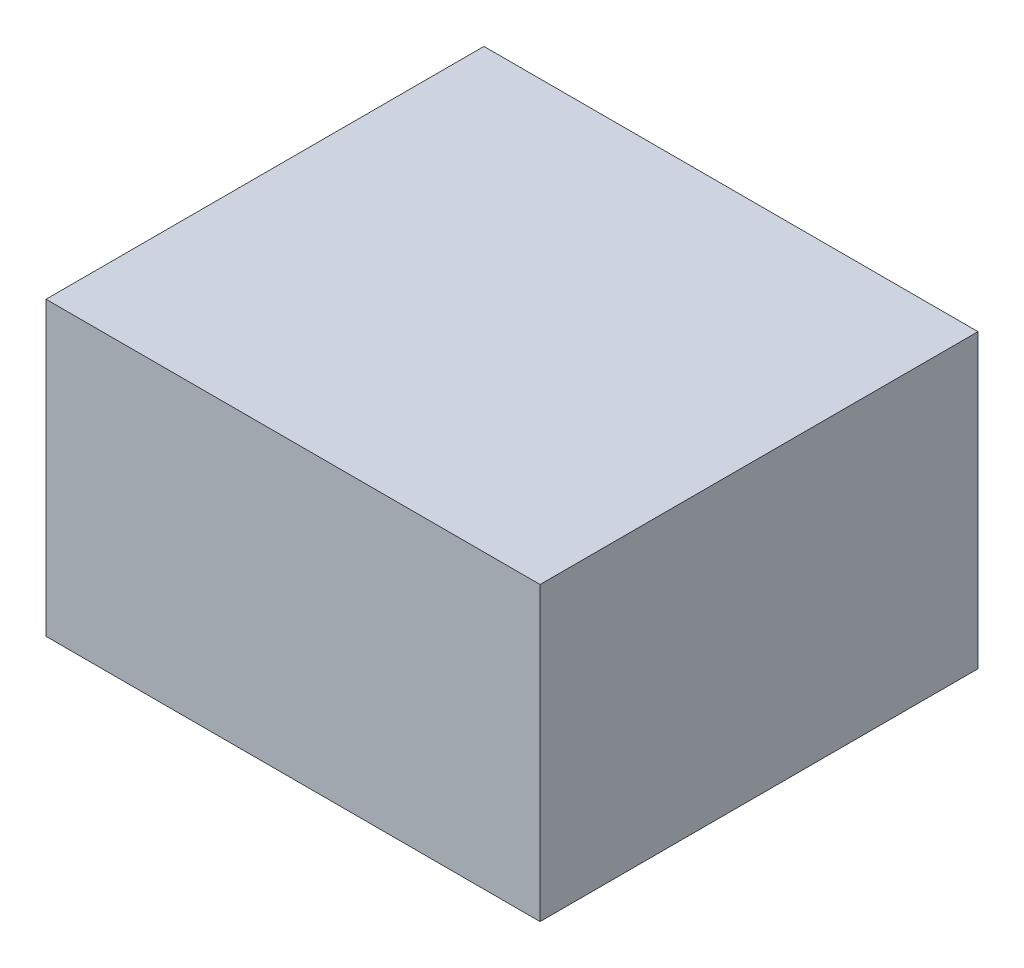
ISO-10303-21;
HEADER;
FILE_DESCRIPTION(('STEP AP214'),'2;1');
FILE_NAME('part.step','',(''),(''),'','','');
FILE_SCHEMA(('AUTOMOTIVE_DESIGN { 1 0 10303 214 1 1 1 1 }'));
ENDSEC;
DATA;
#1=APPLICATION_CONTEXT('core data for automotive mechanical design processes');
#2=APPLICATION_PROTOCOL_DEFINITION('international standard','automotive_design',2000,#1);
#3=PRODUCT_CONTEXT('',#1,'mechanical');
#4=PRODUCT('Part','Part','',(#3));
#5=PRODUCT_RELATED_PRODUCT_CATEGORY('part','',(#4));
#6=PRODUCT_DEFINITION_FORMATION('','',#4);
#7=PRODUCT_DEFINITION_CONTEXT('part definition',#1,'design');
#8=PRODUCT_DEFINITION('design','',#6,#7);
#9=PRODUCT_DEFINITION_SHAPE('','',#8);
#10=(LENGTH_UNIT() NAMED_UNIT(*) SI_UNIT(.MILLI.,.METRE.));
#11=(NAMED_UNIT(*) PLANE_ANGLE_UNIT() SI_UNIT($,.RADIAN.));
#12=(NAMED_UNIT(*) SI_UNIT($,.STERADIAN.) SOLID_ANGLE_UNIT());
#13=UNCERTAINTY_MEASURE_WITH_UNIT(LENGTH_MEASURE(1.E-05),#10,'distance_accuracy_value','');
#14=(GEOMETRIC_REPRESENTATION_CONTEXT(3) GLOBAL_UNCERTAINTY_ASSIGNED_CONTEXT((#13)) GLOBAL_UNIT_ASSIGNED_CONTEXT((#10,
#11,#12)) REPRESENTATION_CONTEXT('',''));
#15=CARTESIAN_POINT('',(0.,0.,0.));
#16=DIRECTION('',(0.,0.,1.));
#17=DIRECTION('',(1.,0.,0.));
#18=AXIS2_PLACEMENT_3D('',#15,#16,#17);
#19=CARTESIAN_POINT('',(-0.5588,0.33020254,0.));
#20=DIRECTION('',(0.,1.,0.));
#21=DIRECTION('',(1.,0.,0.));
#22=AXIS2_PLACEMENT_3D('',#19,#20,#21);
#23=PLANE('',#22);
#24=DIRECTION('',(0.,0.,1.));
#25=VECTOR('',#24,1.);
#26=CARTESIAN_POINT('',(-0.5588,0.33020254,0.));
#27=LINE('',#26,#25);
#28=CARTESIAN_POINT('',(-0.5588,0.33020254,0.));
#29=VERTEX_POINT('',#28);
#30=CARTESIAN_POINT('',(-0.5588,0.33020254,0.9906));
#31=VERTEX_POINT('',#30);
#32=EDGE_CURVE('E11',#29,#31,#27,.T.);
#33=ORIENTED_EDGE('',*,*,#32,.T.);
#34=DIRECTION('',(1.,0.,0.));
#35=VECTOR('',#34,1.);
#36=CARTESIAN_POINT('',(-0.5588,0.33020254,0.9906));
#37=LINE('',#36,#35);
#38=CARTESIAN_POINT('',(0.5588,0.33020254,0.9906));
#39=VERTEX_POINT('',#38);
#40=EDGE_CURVE('E24',#31,#39,#37,.T.);
#41=ORIENTED_EDGE('',*,*,#40,.T.);
#42=DIRECTION('',(0.,0.,1.));
#43=VECTOR('',#42,1.);
#44=CARTESIAN_POINT('',(0.5588,0.33020254,0.));
#45=LINE('',#44,#43);
#46=CARTESIAN_POINT('',(0.5588,0.33020254,0.));
#47=VERTEX_POINT('',#46);
#48=EDGE_CURVE('E85',#47,#39,#45,.T.);
#49=ORIENTED_EDGE('',*,*,#48,.F.);
#50=DIRECTION('',(1.,0.,0.));
#51=VECTOR('',#50,1.);
#52=CARTESIAN_POINT('',(-0.5588,0.33020254,0.));
#53=LINE('',#52,#51);
#54=EDGE_CURVE('E83',#29,#47,#53,.T.);
#55=ORIENTED_EDGE('',*,*,#54,.F.);
#56=EDGE_LOOP('',(#33,#41,#49,#55));
#57=FACE_BOUND('',#56,.T.);
#58=ADVANCED_FACE('F17',(#57),#23,.T.);
#59=CARTESIAN_POINT('',(0.5588,0.33020254,0.));
#60=DIRECTION('',(0.999999999992604,-3.84613902721648E-06,0.));
#61=DIRECTION('',(-3.84613902721648E-06,-0.999999999992604,0.));
#62=AXIS2_PLACEMENT_3D('',#59,#60,#61);
#63=PLANE('',#62);
#64=ORIENTED_EDGE('',*,*,#48,.T.);
#65=DIRECTION('',(-3.84613902721648E-06,-0.999999999992604,0.));
#66=VECTOR('',#65,1.);
#67=CARTESIAN_POINT('',(0.5588,0.33020254,0.9906));
#68=LINE('',#67,#66);
#69=CARTESIAN_POINT('',(0.55879746,-0.3302,0.9906));
#70=VERTEX_POINT('',#69);
#71=EDGE_CURVE('E81',#39,#70,#68,.T.);
#72=ORIENTED_EDGE('',*,*,#71,.T.);
#73=DIRECTION('',(0.,0.,1.));
#74=VECTOR('',#73,1.);
#75=CARTESIAN_POINT('',(0.55879746,-0.3302,0.));
#76=LINE('',#75,#74);
#77=CARTESIAN_POINT('',(0.55879746,-0.3302,0.));
#78=VERTEX_POINT('',#77);
#79=EDGE_CURVE('E79',#78,#70,#76,.T.);
#80=ORIENTED_EDGE('',*,*,#79,.F.);
#81=DIRECTION('',(-3.84613902721648E-06,-0.999999999992604,0.));
#82=VECTOR('',#81,1.);
#83=CARTESIAN_POINT('',(0.5588,0.33020254,0.));
#84=LINE('',#83,#82);
#85=EDGE_CURVE('E70',#47,#78,#84,.T.);
#86=ORIENTED_EDGE('',*,*,#85,.F.);
#87=EDGE_LOOP('',(#64,#72,#80,#86));
#88=FACE_BOUND('',#87,.T.);
#89=ADVANCED_FACE('F90',(#88),#63,.T.);
#90=CARTESIAN_POINT('',(0.55879746,-0.3302,0.));
#91=DIRECTION('',(-4.5454752076415E-06,-0.999999999989669,0.));
#92=DIRECTION('',(-0.999999999989669,4.5454752076415E-06,0.));
#93=AXIS2_PLACEMENT_3D('',#90,#91,#92);
#94=PLANE('',#93);
#95=ORIENTED_EDGE('',*,*,#79,.T.);
#96=DIRECTION('',(-0.999999999989669,4.5454752076415E-06,0.));
#97=VECTOR('',#96,1.);
#98=CARTESIAN_POINT('',(0.55879746,-0.3302,0.9906));
#99=LINE('',#98,#97);
#100=CARTESIAN_POINT('',(-0.55879746,-0.33019492,0.9906));
#101=VERTEX_POINT('',#100);
#102=EDGE_CURVE('E60',#70,#101,#99,.T.);
#103=ORIENTED_EDGE('',*,*,#102,.T.);
#104=DIRECTION('',(0.,0.,1.));
#105=VECTOR('',#104,1.);
#106=CARTESIAN_POINT('',(-0.55879746,-0.33019492,0.));
#107=LINE('',#106,#105);
#108=CARTESIAN_POINT('',(-0.55879746,-0.33019492,0.));
#109=VERTEX_POINT('',#108);
#110=EDGE_CURVE('E54',#109,#101,#107,.T.);
#111=ORIENTED_EDGE('',*,*,#110,.F.);
#112=DIRECTION('',(-0.999999999989669,4.5454752076415E-06,0.));
#113=VECTOR('',#112,1.);
#114=CARTESIAN_POINT('',(0.55879746,-0.3302,0.));
#115=LINE('',#114,#113);
#116=EDGE_CURVE('E58',#78,#109,#115,.T.);
#117=ORIENTED_EDGE('',*,*,#116,.F.);
#118=EDGE_LOOP('',(#95,#103,#111,#117));
#119=FACE_BOUND('',#118,.T.);
#120=ADVANCED_FACE('F57',(#119),#94,.T.);
#121=CARTESIAN_POINT('',(-0.55879746,-0.33019492,0.));
#122=DIRECTION('',(-0.999999999992603,-3.84616863453447E-06,0.));
#123=DIRECTION('',(-3.84616863453447E-06,0.999999999992603,0.));
#124=AXIS2_PLACEMENT_3D('',#121,#122,#123);
#125=PLANE('',#124);
#126=ORIENTED_EDGE('',*,*,#110,.T.);
#127=DIRECTION('',(-3.84616863453447E-06,0.999999999992603,0.));
#128=VECTOR('',#127,1.);
#129=CARTESIAN_POINT('',(-0.55879746,-0.33019492,0.9906));
#130=LINE('',#129,#128);
#131=EDGE_CURVE('E71',#101,#31,#130,.T.);
#132=ORIENTED_EDGE('',*,*,#131,.T.);
#133=ORIENTED_EDGE('',*,*,#32,.F.);
#134=DIRECTION('',(-3.84616863453447E-06,0.999999999992603,0.));
#135=VECTOR('',#134,1.);
#136=CARTESIAN_POINT('',(-0.55879746,-0.33019492,0.));
#137=LINE('',#136,#135);
#138=EDGE_CURVE('E68',#109,#29,#137,.T.);
#139=ORIENTED_EDGE('',*,*,#138,.F.);
#140=EDGE_LOOP('',(#126,#132,#133,#139));
#141=FACE_BOUND('',#140,.T.);
#142=ADVANCED_FACE('F73',(#141),#125,.T.);
#143=CARTESIAN_POINT('',(7.982850370108E-07,3.011712070098E-06,0.));
#144=DIRECTION('',(0.,0.,-1.));
#145=DIRECTION('',(-1.,0.,0.));
#146=AXIS2_PLACEMENT_3D('',#143,#144,#145);
#147=PLANE('',#146);
#148=ORIENTED_EDGE('',*,*,#54,.T.);
#149=ORIENTED_EDGE('',*,*,#85,.T.);
#150=ORIENTED_EDGE('',*,*,#116,.T.);
#151=ORIENTED_EDGE('',*,*,#138,.T.);
#152=EDGE_LOOP('',(#148,#149,#150,#151));
#153=FACE_BOUND('',#152,.T.);
#154=ADVANCED_FACE('F67',(#153),#147,.T.);
#155=CARTESIAN_POINT('',(7.982850370108E-07,3.011712070098E-06,0.9906));
#156=DIRECTION('',(0.,0.,-1.));
#157=DIRECTION('',(-1.,0.,0.));
#158=AXIS2_PLACEMENT_3D('',#155,#156,#157);
#159=PLANE('',#158);
#160=ORIENTED_EDGE('',*,*,#131,.F.);
#161=ORIENTED_EDGE('',*,*,#102,.F.);
#162=ORIENTED_EDGE('',*,*,#71,.F.);
#163=ORIENTED_EDGE('',*,*,#40,.F.);
#164=EDGE_LOOP('',(#160,#161,#162,#163));
#165=FACE_BOUND('',#164,.T.);
#166=ADVANCED_FACE('F91',(#165),#159,.F.);
#167=CLOSED_SHELL('',(#58,#89,#120,#142,#154,#166));
#168=MANIFOLD_SOLID_BREP('B1',#167);
#169=ADVANCED_BREP_SHAPE_REPRESENTATION('',(#18,#168),#14);
#170=SHAPE_DEFINITION_REPRESENTATION(#9,#169);
ENDSEC;
END-ISO-10303-21;
